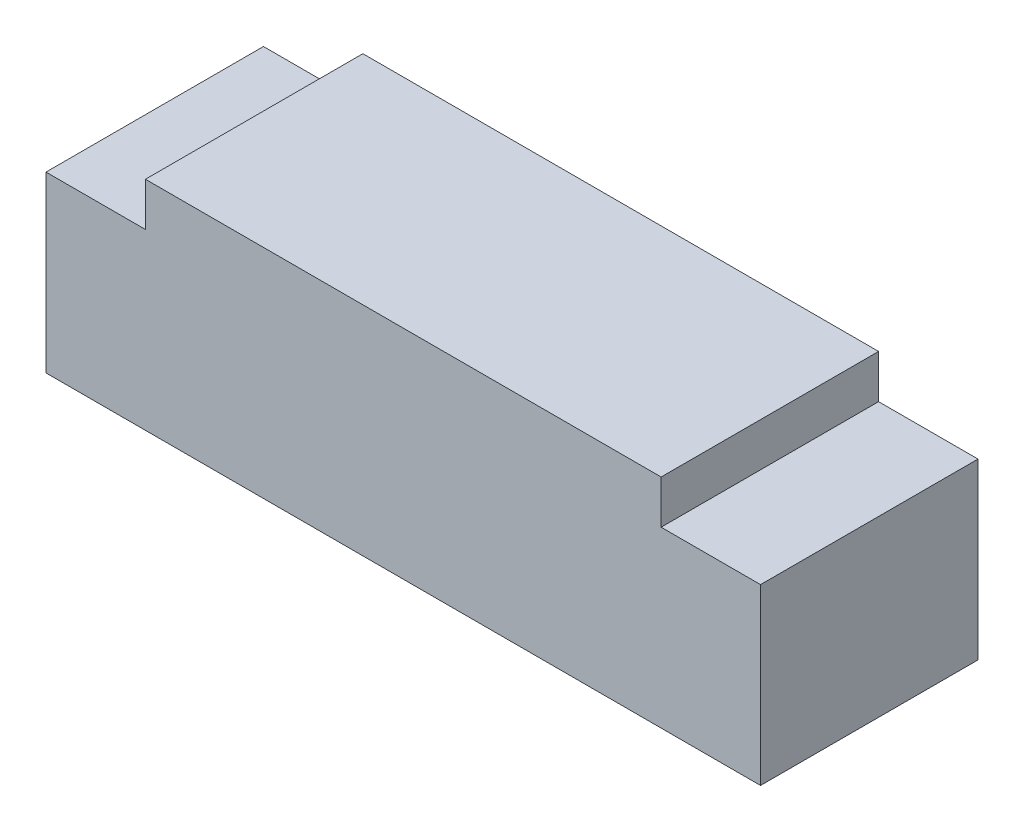
ISO-10303-21;
HEADER;
FILE_DESCRIPTION(('STEP AP214'),'2;1');
FILE_NAME('part.step','',(''),(''),'','','');
FILE_SCHEMA(('AUTOMOTIVE_DESIGN { 1 0 10303 214 1 1 1 1 }'));
ENDSEC;
DATA;
#1=APPLICATION_CONTEXT('core data for automotive mechanical design processes');
#2=APPLICATION_PROTOCOL_DEFINITION('international standard','automotive_design',2000,#1);
#3=PRODUCT_CONTEXT('',#1,'mechanical');
#4=PRODUCT('Part','Part','',(#3));
#5=PRODUCT_RELATED_PRODUCT_CATEGORY('part','',(#4));
#6=PRODUCT_DEFINITION_FORMATION('','',#4);
#7=PRODUCT_DEFINITION_CONTEXT('part definition',#1,'design');
#8=PRODUCT_DEFINITION('design','',#6,#7);
#9=PRODUCT_DEFINITION_SHAPE('','',#8);
#10=(LENGTH_UNIT() NAMED_UNIT(*) SI_UNIT(.MILLI.,.METRE.));
#11=(NAMED_UNIT(*) PLANE_ANGLE_UNIT() SI_UNIT($,.RADIAN.));
#12=(NAMED_UNIT(*) SI_UNIT($,.STERADIAN.) SOLID_ANGLE_UNIT());
#13=UNCERTAINTY_MEASURE_WITH_UNIT(LENGTH_MEASURE(1.E-05),#10,'distance_accuracy_value','');
#14=(GEOMETRIC_REPRESENTATION_CONTEXT(3) GLOBAL_UNCERTAINTY_ASSIGNED_CONTEXT((#13)) GLOBAL_UNIT_ASSIGNED_CONTEXT((#10,
#11,#12)) REPRESENTATION_CONTEXT('',''));
#15=CARTESIAN_POINT('',(0.,0.,0.));
#16=DIRECTION('',(0.,0.,1.));
#17=DIRECTION('',(1.,0.,0.));
#18=AXIS2_PLACEMENT_3D('',#15,#16,#17);
#19=CARTESIAN_POINT('',(0.,5.00000000000402,-19.95));
#20=DIRECTION('',(0.,1.,0.));
#21=DIRECTION('',(1.,0.,0.));
#22=AXIS2_PLACEMENT_3D('',#19,#20,#21);
#23=PLANE('',#22);
#24=DIRECTION('',(-1.,0.,0.));
#25=VECTOR('',#24,1.);
#26=CARTESIAN_POINT('',(5.75,5.00000000000402,-21.7));
#27=LINE('',#26,#25);
#28=CARTESIAN_POINT('',(5.75,5.00000000000402,-21.7));
#29=VERTEX_POINT('',#28);
#30=CARTESIAN_POINT('',(-5.75,5.00000000000402,-21.7));
#31=VERTEX_POINT('',#30);
#32=EDGE_CURVE('E27',#29,#31,#27,.T.);
#33=ORIENTED_EDGE('',*,*,#32,.F.);
#34=DIRECTION('',(0.,0.,-1.));
#35=VECTOR('',#34,1.);
#36=CARTESIAN_POINT('',(5.75,5.00000000000402,-18.2));
#37=LINE('',#36,#35);
#38=CARTESIAN_POINT('',(5.75,5.00000000000402,-18.2));
#39=VERTEX_POINT('',#38);
#40=EDGE_CURVE('E143',#39,#29,#37,.T.);
#41=ORIENTED_EDGE('',*,*,#40,.F.);
#42=DIRECTION('',(-1.,0.,0.));
#43=VECTOR('',#42,1.);
#44=CARTESIAN_POINT('',(-4.15,5.00000000000402,-18.2));
#45=LINE('',#44,#43);
#46=CARTESIAN_POINT('',(-5.75,5.00000000000402,-18.2));
#47=VERTEX_POINT('',#46);
#48=EDGE_CURVE('E150',#39,#47,#45,.T.);
#49=ORIENTED_EDGE('',*,*,#48,.T.);
#50=DIRECTION('',(0.,0.,-1.));
#51=VECTOR('',#50,1.);
#52=CARTESIAN_POINT('',(-5.75,5.00000000000402,-18.2));
#53=LINE('',#52,#51);
#54=EDGE_CURVE('E122',#47,#31,#53,.T.);
#55=ORIENTED_EDGE('',*,*,#54,.T.);
#56=EDGE_LOOP('',(#33,#41,#49,#55));
#57=FACE_BOUND('',#56,.T.);
#58=ADVANCED_FACE('F16',(#57),#23,.F.);
#59=CARTESIAN_POINT('',(0.,8.50000000000401,-19.95));
#60=DIRECTION('',(0.,1.,0.));
#61=DIRECTION('',(1.,0.,0.));
#62=AXIS2_PLACEMENT_3D('',#59,#60,#61);
#63=PLANE('',#62);
#64=DIRECTION('',(-1.,0.,0.));
#65=VECTOR('',#64,1.);
#66=CARTESIAN_POINT('',(5.75,8.50000000000401,-21.7));
#67=LINE('',#66,#65);
#68=CARTESIAN_POINT('',(4.15,8.50000000000401,-21.7));
#69=VERTEX_POINT('',#68);
#70=CARTESIAN_POINT('',(-4.15,8.50000000000401,-21.7));
#71=VERTEX_POINT('',#70);
#72=EDGE_CURVE('E11',#69,#71,#67,.T.);
#73=ORIENTED_EDGE('',*,*,#72,.T.);
#74=DIRECTION('',(0.,0.,1.));
#75=VECTOR('',#74,1.);
#76=CARTESIAN_POINT('',(-4.15,8.50000000000401,-21.7));
#77=LINE('',#76,#75);
#78=CARTESIAN_POINT('',(-4.15,8.50000000000401,-18.2));
#79=VERTEX_POINT('',#78);
#80=EDGE_CURVE('E178',#71,#79,#77,.T.);
#81=ORIENTED_EDGE('',*,*,#80,.T.);
#82=DIRECTION('',(1.,0.,0.));
#83=VECTOR('',#82,1.);
#84=CARTESIAN_POINT('',(-4.15,8.50000000000401,-18.2));
#85=LINE('',#84,#83);
#86=CARTESIAN_POINT('',(4.15,8.50000000000401,-18.2));
#87=VERTEX_POINT('',#86);
#88=EDGE_CURVE('E159',#79,#87,#85,.T.);
#89=ORIENTED_EDGE('',*,*,#88,.T.);
#90=DIRECTION('',(0.,0.,-1.));
#91=VECTOR('',#90,1.);
#92=CARTESIAN_POINT('',(4.15,8.50000000000401,-21.7));
#93=LINE('',#92,#91);
#94=EDGE_CURVE('E151',#87,#69,#93,.T.);
#95=ORIENTED_EDGE('',*,*,#94,.T.);
#96=EDGE_LOOP('',(#73,#81,#89,#95));
#97=FACE_BOUND('',#96,.T.);
#98=ADVANCED_FACE('F247',(#97),#63,.T.);
#99=CARTESIAN_POINT('',(4.15,5.00000000000402,-21.7));
#100=DIRECTION('',(0.,0.,-1.));
#101=DIRECTION('',(0.,-1.,0.));
#102=AXIS2_PLACEMENT_3D('',#99,#100,#101);
#103=PLANE('',#102);
#104=ORIENTED_EDGE('',*,*,#32,.T.);
#105=DIRECTION('',(0.,1.,0.));
#106=VECTOR('',#105,1.);
#107=CARTESIAN_POINT('',(-5.75,5.00000000000402,-21.7));
#108=LINE('',#107,#106);
#109=CARTESIAN_POINT('',(-5.75,7.80000000000402,-21.7));
#110=VERTEX_POINT('',#109);
#111=EDGE_CURVE('E118',#31,#110,#108,.T.);
#112=ORIENTED_EDGE('',*,*,#111,.T.);
#113=DIRECTION('',(-1.,0.,0.));
#114=VECTOR('',#113,1.);
#115=CARTESIAN_POINT('',(-5.75,7.80000000000402,-21.7));
#116=LINE('',#115,#114);
#117=CARTESIAN_POINT('',(-4.15,7.80000000000402,-21.7));
#118=VERTEX_POINT('',#117);
#119=EDGE_CURVE('E108',#118,#110,#116,.T.);
#120=ORIENTED_EDGE('',*,*,#119,.F.);
#121=DIRECTION('',(0.,1.,0.));
#122=VECTOR('',#121,1.);
#123=CARTESIAN_POINT('',(-4.15,5.00000000000402,-21.7));
#124=LINE('',#123,#122);
#125=EDGE_CURVE('E132',#118,#71,#124,.T.);
#126=ORIENTED_EDGE('',*,*,#125,.T.);
#127=ORIENTED_EDGE('',*,*,#72,.F.);
#128=DIRECTION('',(0.,1.,0.));
#129=VECTOR('',#128,1.);
#130=CARTESIAN_POINT('',(4.15,5.00000000000402,-21.7));
#131=LINE('',#130,#129);
#132=CARTESIAN_POINT('',(4.15,7.80000000000402,-21.7));
#133=VERTEX_POINT('',#132);
#134=EDGE_CURVE('E161',#133,#69,#131,.T.);
#135=ORIENTED_EDGE('',*,*,#134,.F.);
#136=DIRECTION('',(-1.,0.,0.));
#137=VECTOR('',#136,1.);
#138=CARTESIAN_POINT('',(5.75,7.80000000000402,-21.7));
#139=LINE('',#138,#137);
#140=CARTESIAN_POINT('',(5.75,7.80000000000402,-21.7));
#141=VERTEX_POINT('',#140);
#142=EDGE_CURVE('E167',#141,#133,#139,.T.);
#143=ORIENTED_EDGE('',*,*,#142,.F.);
#144=DIRECTION('',(0.,1.,0.));
#145=VECTOR('',#144,1.);
#146=CARTESIAN_POINT('',(5.75,5.00000000000402,-21.7));
#147=LINE('',#146,#145);
#148=EDGE_CURVE('E138',#29,#141,#147,.T.);
#149=ORIENTED_EDGE('',*,*,#148,.F.);
#150=EDGE_LOOP('',(#104,#112,#120,#126,#127,#135,#143,#149));
#151=FACE_BOUND('',#150,.T.);
#152=ADVANCED_FACE('F192',(#151),#103,.T.);
#153=CARTESIAN_POINT('',(-4.15,5.00000000000402,-21.7));
#154=DIRECTION('',(-1.,0.,0.));
#155=DIRECTION('',(0.,0.,1.));
#156=AXIS2_PLACEMENT_3D('',#153,#154,#155);
#157=PLANE('',#156);
#158=DIRECTION('',(0.,0.,1.));
#159=VECTOR('',#158,1.);
#160=CARTESIAN_POINT('',(-4.15,7.80000000000402,-20.825));
#161=LINE('',#160,#159);
#162=CARTESIAN_POINT('',(-4.15,7.80000000000402,-18.2));
#163=VERTEX_POINT('',#162);
#164=EDGE_CURVE('E107',#118,#163,#161,.T.);
#165=ORIENTED_EDGE('',*,*,#164,.T.);
#166=DIRECTION('',(0.,1.,0.));
#167=VECTOR('',#166,1.);
#168=CARTESIAN_POINT('',(-4.15,5.00000000000402,-18.2));
#169=LINE('',#168,#167);
#170=EDGE_CURVE('E102',#163,#79,#169,.T.);
#171=ORIENTED_EDGE('',*,*,#170,.T.);
#172=ORIENTED_EDGE('',*,*,#80,.F.);
#173=ORIENTED_EDGE('',*,*,#125,.F.);
#174=EDGE_LOOP('',(#165,#171,#172,#173));
#175=FACE_BOUND('',#174,.T.);
#176=ADVANCED_FACE('F190',(#175),#157,.T.);
#177=CARTESIAN_POINT('',(-4.15,5.00000000000402,-18.2));
#178=DIRECTION('',(0.,0.,1.));
#179=DIRECTION('',(1.,0.,0.));
#180=AXIS2_PLACEMENT_3D('',#177,#178,#179);
#181=PLANE('',#180);
#182=ORIENTED_EDGE('',*,*,#48,.F.);
#183=DIRECTION('',(0.,1.,0.));
#184=VECTOR('',#183,1.);
#185=CARTESIAN_POINT('',(5.75,5.00000000000402,-18.2));
#186=LINE('',#185,#184);
#187=CARTESIAN_POINT('',(5.75,7.80000000000402,-18.2));
#188=VERTEX_POINT('',#187);
#189=EDGE_CURVE('E146',#39,#188,#186,.T.);
#190=ORIENTED_EDGE('',*,*,#189,.T.);
#191=DIRECTION('',(1.,0.,0.));
#192=VECTOR('',#191,1.);
#193=CARTESIAN_POINT('',(4.15,7.80000000000402,-18.2));
#194=LINE('',#193,#192);
#195=CARTESIAN_POINT('',(4.15,7.80000000000402,-18.2));
#196=VERTEX_POINT('',#195);
#197=EDGE_CURVE('E20',#196,#188,#194,.T.);
#198=ORIENTED_EDGE('',*,*,#197,.F.);
#199=DIRECTION('',(0.,1.,0.));
#200=VECTOR('',#199,1.);
#201=CARTESIAN_POINT('',(4.15,5.00000000000402,-18.2));
#202=LINE('',#201,#200);
#203=EDGE_CURVE('E147',#196,#87,#202,.T.);
#204=ORIENTED_EDGE('',*,*,#203,.T.);
#205=ORIENTED_EDGE('',*,*,#88,.F.);
#206=ORIENTED_EDGE('',*,*,#170,.F.);
#207=DIRECTION('',(1.,0.,0.));
#208=VECTOR('',#207,1.);
#209=CARTESIAN_POINT('',(-4.15,7.80000000000402,-18.2));
#210=LINE('',#209,#208);
#211=CARTESIAN_POINT('',(-5.75,7.80000000000402,-18.2));
#212=VERTEX_POINT('',#211);
#213=EDGE_CURVE('E93',#212,#163,#210,.T.);
#214=ORIENTED_EDGE('',*,*,#213,.F.);
#215=DIRECTION('',(0.,1.,0.));
#216=VECTOR('',#215,1.);
#217=CARTESIAN_POINT('',(-5.75,5.00000000000402,-18.2));
#218=LINE('',#217,#216);
#219=EDGE_CURVE('E98',#47,#212,#218,.T.);
#220=ORIENTED_EDGE('',*,*,#219,.F.);
#221=EDGE_LOOP('',(#182,#190,#198,#204,#205,#206,#214,#220));
#222=FACE_BOUND('',#221,.T.);
#223=ADVANCED_FACE('F96',(#222),#181,.T.);
#224=CARTESIAN_POINT('',(4.15,5.00000000000402,-18.2));
#225=DIRECTION('',(1.,0.,0.));
#226=DIRECTION('',(0.,1.,0.));
#227=AXIS2_PLACEMENT_3D('',#224,#225,#226);
#228=PLANE('',#227);
#229=DIRECTION('',(0.,0.,-1.));
#230=VECTOR('',#229,1.);
#231=CARTESIAN_POINT('',(4.15,7.80000000000402,-19.075));
#232=LINE('',#231,#230);
#233=EDGE_CURVE('E198',#196,#133,#232,.T.);
#234=ORIENTED_EDGE('',*,*,#233,.T.);
#235=ORIENTED_EDGE('',*,*,#134,.T.);
#236=ORIENTED_EDGE('',*,*,#94,.F.);
#237=ORIENTED_EDGE('',*,*,#203,.F.);
#238=EDGE_LOOP('',(#234,#235,#236,#237));
#239=FACE_BOUND('',#238,.T.);
#240=ADVANCED_FACE('F220',(#239),#228,.T.);
#241=CARTESIAN_POINT('',(4.95,7.80000000000402,-19.95));
#242=DIRECTION('',(0.,1.,0.));
#243=DIRECTION('',(1.,0.,0.));
#244=AXIS2_PLACEMENT_3D('',#241,#242,#243);
#245=PLANE('',#244);
#246=ORIENTED_EDGE('',*,*,#233,.F.);
#247=ORIENTED_EDGE('',*,*,#197,.T.);
#248=DIRECTION('',(0.,0.,-1.));
#249=VECTOR('',#248,1.);
#250=CARTESIAN_POINT('',(5.75,7.80000000000402,-18.2));
#251=LINE('',#250,#249);
#252=EDGE_CURVE('E142',#188,#141,#251,.T.);
#253=ORIENTED_EDGE('',*,*,#252,.T.);
#254=ORIENTED_EDGE('',*,*,#142,.T.);
#255=EDGE_LOOP('',(#246,#247,#253,#254));
#256=FACE_BOUND('',#255,.T.);
#257=ADVANCED_FACE('F18',(#256),#245,.T.);
#258=CARTESIAN_POINT('',(5.75,5.00000000000402,-18.2));
#259=DIRECTION('',(1.,0.,0.));
#260=DIRECTION('',(0.,1.,0.));
#261=AXIS2_PLACEMENT_3D('',#258,#259,#260);
#262=PLANE('',#261);
#263=ORIENTED_EDGE('',*,*,#40,.T.);
#264=ORIENTED_EDGE('',*,*,#148,.T.);
#265=ORIENTED_EDGE('',*,*,#252,.F.);
#266=ORIENTED_EDGE('',*,*,#189,.F.);
#267=EDGE_LOOP('',(#263,#264,#265,#266));
#268=FACE_BOUND('',#267,.T.);
#269=ADVANCED_FACE('F236',(#268),#262,.T.);
#270=CARTESIAN_POINT('',(-4.95,7.80000000000402,-19.95));
#271=DIRECTION('',(0.,1.,0.));
#272=DIRECTION('',(1.,0.,0.));
#273=AXIS2_PLACEMENT_3D('',#270,#271,#272);
#274=PLANE('',#273);
#275=ORIENTED_EDGE('',*,*,#119,.T.);
#276=DIRECTION('',(0.,0.,1.));
#277=VECTOR('',#276,1.);
#278=CARTESIAN_POINT('',(-5.75,7.80000000000402,-18.2));
#279=LINE('',#278,#277);
#280=EDGE_CURVE('E111',#110,#212,#279,.T.);
#281=ORIENTED_EDGE('',*,*,#280,.T.);
#282=ORIENTED_EDGE('',*,*,#213,.T.);
#283=ORIENTED_EDGE('',*,*,#164,.F.);
#284=EDGE_LOOP('',(#275,#281,#282,#283));
#285=FACE_BOUND('',#284,.T.);
#286=ADVANCED_FACE('F112',(#285),#274,.T.);
#287=CARTESIAN_POINT('',(-5.75,5.00000000000402,-21.7));
#288=DIRECTION('',(-1.,0.,0.));
#289=DIRECTION('',(0.,0.,1.));
#290=AXIS2_PLACEMENT_3D('',#287,#288,#289);
#291=PLANE('',#290);
#292=ORIENTED_EDGE('',*,*,#54,.F.);
#293=ORIENTED_EDGE('',*,*,#219,.T.);
#294=ORIENTED_EDGE('',*,*,#280,.F.);
#295=ORIENTED_EDGE('',*,*,#111,.F.);
#296=EDGE_LOOP('',(#292,#293,#294,#295));
#297=FACE_BOUND('',#296,.T.);
#298=ADVANCED_FACE('F120',(#297),#291,.T.);
#299=CLOSED_SHELL('',(#58,#98,#152,#176,#223,#240,#257,#269,#286,#298));
#300=MANIFOLD_SOLID_BREP('B1',#299);
#301=ADVANCED_BREP_SHAPE_REPRESENTATION('',(#18,#300),#14);
#302=SHAPE_DEFINITION_REPRESENTATION(#9,#301);
ENDSEC;
END-ISO-10303-21;
